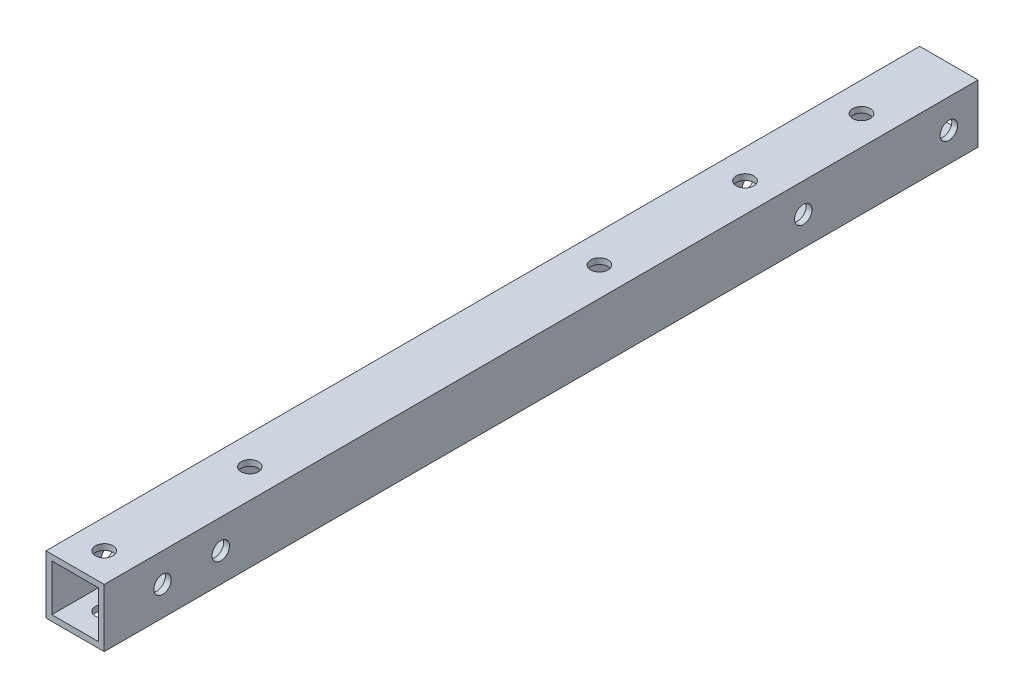
ISO-10303-21;
HEADER;
FILE_DESCRIPTION(('STEP AP214'),'2;1');
FILE_NAME('part.step','',(''),(''),'','','');
FILE_SCHEMA(('AUTOMOTIVE_DESIGN { 1 0 10303 214 1 1 1 1 }'));
ENDSEC;
DATA;
#1=APPLICATION_CONTEXT('core data for automotive mechanical design processes');
#2=APPLICATION_PROTOCOL_DEFINITION('international standard','automotive_design',2000,#1);
#3=PRODUCT_CONTEXT('',#1,'mechanical');
#4=PRODUCT('Part','Part','',(#3));
#5=PRODUCT_RELATED_PRODUCT_CATEGORY('part','',(#4));
#6=PRODUCT_DEFINITION_FORMATION('','',#4);
#7=PRODUCT_DEFINITION_CONTEXT('part definition',#1,'design');
#8=PRODUCT_DEFINITION('design','',#6,#7);
#9=PRODUCT_DEFINITION_SHAPE('','',#8);
#10=(LENGTH_UNIT() NAMED_UNIT(*) SI_UNIT(.MILLI.,.METRE.));
#11=(NAMED_UNIT(*) PLANE_ANGLE_UNIT() SI_UNIT($,.RADIAN.));
#12=(NAMED_UNIT(*) SI_UNIT($,.STERADIAN.) SOLID_ANGLE_UNIT());
#13=UNCERTAINTY_MEASURE_WITH_UNIT(LENGTH_MEASURE(1.E-05),#10,'distance_accuracy_value','');
#14=(GEOMETRIC_REPRESENTATION_CONTEXT(3) GLOBAL_UNCERTAINTY_ASSIGNED_CONTEXT((#13)) GLOBAL_UNIT_ASSIGNED_CONTEXT((#10,
#11,#12)) REPRESENTATION_CONTEXT('',''));
#15=CARTESIAN_POINT('',(0.,0.,0.));
#16=DIRECTION('',(0.,0.,1.));
#17=DIRECTION('',(1.,0.,0.));
#18=AXIS2_PLACEMENT_3D('',#15,#16,#17);
#19=CARTESIAN_POINT('',(0.,0.,150.));
#20=DIRECTION('',(0.,0.,1.));
#21=DIRECTION('',(1.,0.,0.));
#22=AXIS2_PLACEMENT_3D('',#19,#20,#21);
#23=PLANE('',#22);
#24=DIRECTION('',(0.,1.,0.));
#25=VECTOR('',#24,1.);
#26=CARTESIAN_POINT('',(216.70379394576,104.487320339915,150.));
#27=LINE('',#26,#25);
#28=CARTESIAN_POINT('',(216.70379394576,94.4873203399152,150.));
#29=VERTEX_POINT('',#28);
#30=CARTESIAN_POINT('',(216.70379394576,104.487320339915,150.));
#31=VERTEX_POINT('',#30);
#32=EDGE_CURVE('E168',#29,#31,#27,.T.);
#33=ORIENTED_EDGE('',*,*,#32,.T.);
#34=DIRECTION('',(-1.,0.,0.));
#35=VECTOR('',#34,1.);
#36=CARTESIAN_POINT('',(216.70379394576,104.487320339915,150.));
#37=LINE('',#36,#35);
#38=CARTESIAN_POINT('',(206.70379394576,104.487320339915,150.));
#39=VERTEX_POINT('',#38);
#40=EDGE_CURVE('E171',#31,#39,#37,.T.);
#41=ORIENTED_EDGE('',*,*,#40,.T.);
#42=DIRECTION('',(0.,-1.,0.));
#43=VECTOR('',#42,1.);
#44=CARTESIAN_POINT('',(206.70379394576,104.487320339915,150.));
#45=LINE('',#44,#43);
#46=CARTESIAN_POINT('',(206.70379394576,94.4873203399152,150.));
#47=VERTEX_POINT('',#46);
#48=EDGE_CURVE('E174',#39,#47,#45,.T.);
#49=ORIENTED_EDGE('',*,*,#48,.T.);
#50=DIRECTION('',(1.,0.,0.));
#51=VECTOR('',#50,1.);
#52=CARTESIAN_POINT('',(216.70379394576,94.4873203399152,150.));
#53=LINE('',#52,#51);
#54=EDGE_CURVE('E176',#47,#29,#53,.T.);
#55=ORIENTED_EDGE('',*,*,#54,.T.);
#56=EDGE_LOOP('',(#33,#41,#49,#55));
#57=FACE_BOUND('',#56,.T.);
#58=DIRECTION('',(-1.,0.,0.));
#59=VECTOR('',#58,1.);
#60=CARTESIAN_POINT('',(0.,103.487320339915,150.));
#61=LINE('',#60,#59);
#62=CARTESIAN_POINT('',(215.70379394576,103.487320339915,150.));
#63=VERTEX_POINT('',#62);
#64=CARTESIAN_POINT('',(207.70379394576,103.487320339915,150.));
#65=VERTEX_POINT('',#64);
#66=EDGE_CURVE('E138',#63,#65,#61,.T.);
#67=ORIENTED_EDGE('',*,*,#66,.F.);
#68=DIRECTION('',(0.,1.,0.));
#69=VECTOR('',#68,1.);
#70=CARTESIAN_POINT('',(215.70379394576,0.,150.));
#71=LINE('',#70,#69);
#72=CARTESIAN_POINT('',(215.70379394576,95.4873203399152,150.));
#73=VERTEX_POINT('',#72);
#74=EDGE_CURVE('E130',#73,#63,#71,.T.);
#75=ORIENTED_EDGE('',*,*,#74,.F.);
#76=DIRECTION('',(1.,0.,0.));
#77=VECTOR('',#76,1.);
#78=CARTESIAN_POINT('',(0.,95.4873203399152,150.));
#79=LINE('',#78,#77);
#80=CARTESIAN_POINT('',(207.70379394576,95.4873203399152,150.));
#81=VERTEX_POINT('',#80);
#82=EDGE_CURVE('E152',#81,#73,#79,.T.);
#83=ORIENTED_EDGE('',*,*,#82,.F.);
#84=DIRECTION('',(0.,-1.,0.));
#85=VECTOR('',#84,1.);
#86=CARTESIAN_POINT('',(207.70379394576,0.,150.));
#87=LINE('',#86,#85);
#88=EDGE_CURVE('E150',#65,#81,#87,.T.);
#89=ORIENTED_EDGE('',*,*,#88,.F.);
#90=EDGE_LOOP('',(#67,#75,#83,#89));
#91=FACE_BOUND('',#90,.T.);
#92=ADVANCED_FACE('F63',(#57,#91),#23,.T.);
#93=CARTESIAN_POINT('',(0.,0.,0.));
#94=DIRECTION('',(0.,0.,1.));
#95=DIRECTION('',(1.,0.,0.));
#96=AXIS2_PLACEMENT_3D('',#93,#94,#95);
#97=PLANE('',#96);
#98=DIRECTION('',(0.,1.,0.));
#99=VECTOR('',#98,1.);
#100=CARTESIAN_POINT('',(216.70379394576,104.487320339915,0.));
#101=LINE('',#100,#99);
#102=CARTESIAN_POINT('',(216.70379394576,94.4873203399152,0.));
#103=VERTEX_POINT('',#102);
#104=CARTESIAN_POINT('',(216.70379394576,104.487320339915,0.));
#105=VERTEX_POINT('',#104);
#106=EDGE_CURVE('E146',#103,#105,#101,.T.);
#107=ORIENTED_EDGE('',*,*,#106,.F.);
#108=DIRECTION('',(1.,0.,0.));
#109=VECTOR('',#108,1.);
#110=CARTESIAN_POINT('',(216.70379394576,94.4873203399152,0.));
#111=LINE('',#110,#109);
#112=CARTESIAN_POINT('',(206.70379394576,94.4873203399152,0.));
#113=VERTEX_POINT('',#112);
#114=EDGE_CURVE('E172',#113,#103,#111,.T.);
#115=ORIENTED_EDGE('',*,*,#114,.F.);
#116=DIRECTION('',(0.,-1.,0.));
#117=VECTOR('',#116,1.);
#118=CARTESIAN_POINT('',(206.70379394576,104.487320339915,0.));
#119=LINE('',#118,#117);
#120=CARTESIAN_POINT('',(206.70379394576,104.487320339915,0.));
#121=VERTEX_POINT('',#120);
#122=EDGE_CURVE('E183',#121,#113,#119,.T.);
#123=ORIENTED_EDGE('',*,*,#122,.F.);
#124=DIRECTION('',(-1.,0.,0.));
#125=VECTOR('',#124,1.);
#126=CARTESIAN_POINT('',(216.70379394576,104.487320339915,0.));
#127=LINE('',#126,#125);
#128=EDGE_CURVE('E181',#105,#121,#127,.T.);
#129=ORIENTED_EDGE('',*,*,#128,.F.);
#130=EDGE_LOOP('',(#107,#115,#123,#129));
#131=FACE_BOUND('',#130,.T.);
#132=DIRECTION('',(0.,1.,0.));
#133=VECTOR('',#132,1.);
#134=CARTESIAN_POINT('',(215.70379394576,0.,0.));
#135=LINE('',#134,#133);
#136=CARTESIAN_POINT('',(215.70379394576,95.4873203399152,0.));
#137=VERTEX_POINT('',#136);
#138=CARTESIAN_POINT('',(215.70379394576,103.487320339915,0.));
#139=VERTEX_POINT('',#138);
#140=EDGE_CURVE('E88',#137,#139,#135,.T.);
#141=ORIENTED_EDGE('',*,*,#140,.T.);
#142=DIRECTION('',(-1.,0.,0.));
#143=VECTOR('',#142,1.);
#144=CARTESIAN_POINT('',(0.,103.487320339915,0.));
#145=LINE('',#144,#143);
#146=CARTESIAN_POINT('',(207.70379394576,103.487320339915,0.));
#147=VERTEX_POINT('',#146);
#148=EDGE_CURVE('E145',#139,#147,#145,.T.);
#149=ORIENTED_EDGE('',*,*,#148,.T.);
#150=DIRECTION('',(0.,-1.,0.));
#151=VECTOR('',#150,1.);
#152=CARTESIAN_POINT('',(207.70379394576,0.,0.));
#153=LINE('',#152,#151);
#154=CARTESIAN_POINT('',(207.70379394576,95.4873203399152,0.));
#155=VERTEX_POINT('',#154);
#156=EDGE_CURVE('E160',#147,#155,#153,.T.);
#157=ORIENTED_EDGE('',*,*,#156,.T.);
#158=DIRECTION('',(1.,0.,0.));
#159=VECTOR('',#158,1.);
#160=CARTESIAN_POINT('',(0.,95.4873203399152,0.));
#161=LINE('',#160,#159);
#162=EDGE_CURVE('E139',#155,#137,#161,.T.);
#163=ORIENTED_EDGE('',*,*,#162,.T.);
#164=EDGE_LOOP('',(#141,#149,#157,#163));
#165=FACE_BOUND('',#164,.T.);
#166=ADVANCED_FACE('F294',(#131,#165),#97,.F.);
#167=CARTESIAN_POINT('',(216.70379394576,104.487320339915,150.));
#168=DIRECTION('',(-1.,0.,0.));
#169=DIRECTION('',(0.,0.,1.));
#170=AXIS2_PLACEMENT_3D('',#167,#168,#169);
#171=PLANE('',#170);
#172=CARTESIAN_POINT('',(216.70379394576,99.4873203399151,140.));
#173=DIRECTION('',(1.,0.,0.));
#174=DIRECTION('',(0.,0.,-1.));
#175=AXIS2_PLACEMENT_3D('',#172,#173,#174);
#176=CIRCLE('',#175,1.5);
#177=CARTESIAN_POINT('',(216.70379394576,99.4873203399151,138.5));
#178=VERTEX_POINT('',#177);
#179=EDGE_CURVE('E252',#178,#178,#176,.T.);
#180=ORIENTED_EDGE('',*,*,#179,.F.);
#181=EDGE_LOOP('',(#180));
#182=FACE_BOUND('',#181,.T.);
#183=CARTESIAN_POINT('',(216.70379394576,99.4873203399151,130.));
#184=DIRECTION('',(1.,0.,0.));
#185=DIRECTION('',(0.,0.,-1.));
#186=AXIS2_PLACEMENT_3D('',#183,#184,#185);
#187=CIRCLE('',#186,1.5);
#188=CARTESIAN_POINT('',(216.70379394576,99.4873203399151,128.5));
#189=VERTEX_POINT('',#188);
#190=EDGE_CURVE('E246',#189,#189,#187,.T.);
#191=ORIENTED_EDGE('',*,*,#190,.F.);
#192=EDGE_LOOP('',(#191));
#193=FACE_BOUND('',#192,.T.);
#194=CARTESIAN_POINT('',(216.70379394576,99.4873203399151,5.));
#195=DIRECTION('',(1.,0.,0.));
#196=DIRECTION('',(0.,0.,-1.));
#197=AXIS2_PLACEMENT_3D('',#194,#195,#196);
#198=CIRCLE('',#197,1.5);
#199=CARTESIAN_POINT('',(216.70379394576,99.4873203399151,3.5));
#200=VERTEX_POINT('',#199);
#201=EDGE_CURVE('E239',#200,#200,#198,.T.);
#202=ORIENTED_EDGE('',*,*,#201,.F.);
#203=EDGE_LOOP('',(#202));
#204=FACE_BOUND('',#203,.T.);
#205=CARTESIAN_POINT('',(216.70379394576,99.4873203399151,30.));
#206=DIRECTION('',(1.,0.,0.));
#207=DIRECTION('',(0.,0.,-1.));
#208=AXIS2_PLACEMENT_3D('',#205,#206,#207);
#209=CIRCLE('',#208,1.5);
#210=CARTESIAN_POINT('',(216.70379394576,99.4873203399151,28.5));
#211=VERTEX_POINT('',#210);
#212=EDGE_CURVE('E242',#211,#211,#209,.T.);
#213=ORIENTED_EDGE('',*,*,#212,.F.);
#214=EDGE_LOOP('',(#213));
#215=FACE_BOUND('',#214,.T.);
#216=ORIENTED_EDGE('',*,*,#106,.T.);
#217=DIRECTION('',(0.,0.,-1.));
#218=VECTOR('',#217,1.);
#219=CARTESIAN_POINT('',(216.70379394576,104.487320339915,150.));
#220=LINE('',#219,#218);
#221=EDGE_CURVE('E12',#31,#105,#220,.T.);
#222=ORIENTED_EDGE('',*,*,#221,.F.);
#223=ORIENTED_EDGE('',*,*,#32,.F.);
#224=DIRECTION('',(0.,0.,-1.));
#225=VECTOR('',#224,1.);
#226=CARTESIAN_POINT('',(216.70379394576,94.4873203399152,150.));
#227=LINE('',#226,#225);
#228=EDGE_CURVE('E178',#29,#103,#227,.T.);
#229=ORIENTED_EDGE('',*,*,#228,.T.);
#230=EDGE_LOOP('',(#216,#222,#223,#229));
#231=FACE_BOUND('',#230,.T.);
#232=ADVANCED_FACE('F65',(#182,#193,#204,#215,#231),#171,.F.);
#233=CARTESIAN_POINT('',(216.70379394576,104.487320339915,150.));
#234=DIRECTION('',(0.,-1.,0.));
#235=DIRECTION('',(0.,0.,-1.));
#236=AXIS2_PLACEMENT_3D('',#233,#234,#235);
#237=PLANE('',#236);
#238=CARTESIAN_POINT('',(211.70379394576,104.487320339915,15.));
#239=DIRECTION('',(0.,-1.,0.));
#240=DIRECTION('',(0.,0.,-1.));
#241=AXIS2_PLACEMENT_3D('',#238,#239,#240);
#242=CIRCLE('',#241,1.5);
#243=CARTESIAN_POINT('',(211.70379394576,104.487320339915,13.5));
#244=VERTEX_POINT('',#243);
#245=EDGE_CURVE('E213',#244,#244,#242,.T.);
#246=ORIENTED_EDGE('',*,*,#245,.T.);
#247=EDGE_LOOP('',(#246));
#248=FACE_BOUND('',#247,.T.);
#249=CARTESIAN_POINT('',(211.70379394576,104.487320339915,60.));
#250=DIRECTION('',(0.,-1.,0.));
#251=DIRECTION('',(0.,0.,-1.));
#252=AXIS2_PLACEMENT_3D('',#249,#250,#251);
#253=CIRCLE('',#252,1.5);
#254=CARTESIAN_POINT('',(211.70379394576,104.487320339915,58.5));
#255=VERTEX_POINT('',#254);
#256=EDGE_CURVE('E411',#255,#255,#253,.T.);
#257=ORIENTED_EDGE('',*,*,#256,.T.);
#258=EDGE_LOOP('',(#257));
#259=FACE_BOUND('',#258,.T.);
#260=CARTESIAN_POINT('',(211.70379394576,104.487320339915,145.));
#261=DIRECTION('',(0.,-1.,0.));
#262=DIRECTION('',(0.,0.,-1.));
#263=AXIS2_PLACEMENT_3D('',#260,#261,#262);
#264=CIRCLE('',#263,1.5);
#265=CARTESIAN_POINT('',(211.70379394576,104.487320339915,143.5));
#266=VERTEX_POINT('',#265);
#267=EDGE_CURVE('E405',#266,#266,#264,.T.);
#268=ORIENTED_EDGE('',*,*,#267,.T.);
#269=EDGE_LOOP('',(#268));
#270=FACE_BOUND('',#269,.T.);
#271=CARTESIAN_POINT('',(211.70379394576,104.487320339915,35.));
#272=DIRECTION('',(0.,-1.,0.));
#273=DIRECTION('',(0.,0.,-1.));
#274=AXIS2_PLACEMENT_3D('',#271,#272,#273);
#275=CIRCLE('',#274,1.5);
#276=CARTESIAN_POINT('',(211.70379394576,104.487320339915,33.5));
#277=VERTEX_POINT('',#276);
#278=EDGE_CURVE('E404',#277,#277,#275,.T.);
#279=ORIENTED_EDGE('',*,*,#278,.T.);
#280=EDGE_LOOP('',(#279));
#281=FACE_BOUND('',#280,.T.);
#282=CARTESIAN_POINT('',(211.70379394576,104.487320339915,120.));
#283=DIRECTION('',(0.,-1.,0.));
#284=DIRECTION('',(0.,0.,-1.));
#285=AXIS2_PLACEMENT_3D('',#282,#283,#284);
#286=CIRCLE('',#285,1.5);
#287=CARTESIAN_POINT('',(211.70379394576,104.487320339915,118.5));
#288=VERTEX_POINT('',#287);
#289=EDGE_CURVE('E416',#288,#288,#286,.T.);
#290=ORIENTED_EDGE('',*,*,#289,.T.);
#291=EDGE_LOOP('',(#290));
#292=FACE_BOUND('',#291,.T.);
#293=ORIENTED_EDGE('',*,*,#128,.T.);
#294=DIRECTION('',(0.,0.,-1.));
#295=VECTOR('',#294,1.);
#296=CARTESIAN_POINT('',(206.70379394576,104.487320339915,150.));
#297=LINE('',#296,#295);
#298=EDGE_CURVE('E72',#39,#121,#297,.T.);
#299=ORIENTED_EDGE('',*,*,#298,.F.);
#300=ORIENTED_EDGE('',*,*,#40,.F.);
#301=ORIENTED_EDGE('',*,*,#221,.T.);
#302=EDGE_LOOP('',(#293,#299,#300,#301));
#303=FACE_BOUND('',#302,.T.);
#304=ADVANCED_FACE('F293',(#248,#259,#270,#281,#292,#303),#237,.F.);
#305=CARTESIAN_POINT('',(206.70379394576,104.487320339915,150.));
#306=DIRECTION('',(1.,0.,0.));
#307=DIRECTION('',(0.,0.,-1.));
#308=AXIS2_PLACEMENT_3D('',#305,#306,#307);
#309=PLANE('',#308);
#310=CARTESIAN_POINT('',(206.70379394576,99.4873203399151,140.));
#311=DIRECTION('',(1.,0.,0.));
#312=DIRECTION('',(0.,0.,-1.));
#313=AXIS2_PLACEMENT_3D('',#310,#311,#312);
#314=CIRCLE('',#313,1.5);
#315=CARTESIAN_POINT('',(206.70379394576,99.4873203399151,138.5));
#316=VERTEX_POINT('',#315);
#317=EDGE_CURVE('E238',#316,#316,#314,.T.);
#318=ORIENTED_EDGE('',*,*,#317,.T.);
#319=EDGE_LOOP('',(#318));
#320=FACE_BOUND('',#319,.T.);
#321=CARTESIAN_POINT('',(206.70379394576,99.4873203399151,130.));
#322=DIRECTION('',(1.,0.,0.));
#323=DIRECTION('',(0.,0.,-1.));
#324=AXIS2_PLACEMENT_3D('',#321,#322,#323);
#325=CIRCLE('',#324,1.5);
#326=CARTESIAN_POINT('',(206.70379394576,99.4873203399151,128.5));
#327=VERTEX_POINT('',#326);
#328=EDGE_CURVE('E249',#327,#327,#325,.T.);
#329=ORIENTED_EDGE('',*,*,#328,.T.);
#330=EDGE_LOOP('',(#329));
#331=FACE_BOUND('',#330,.T.);
#332=CARTESIAN_POINT('',(206.70379394576,99.4873203399151,5.));
#333=DIRECTION('',(1.,0.,0.));
#334=DIRECTION('',(0.,0.,-1.));
#335=AXIS2_PLACEMENT_3D('',#332,#333,#334);
#336=CIRCLE('',#335,1.5);
#337=CARTESIAN_POINT('',(206.70379394576,99.4873203399151,3.5));
#338=VERTEX_POINT('',#337);
#339=EDGE_CURVE('E243',#338,#338,#336,.T.);
#340=ORIENTED_EDGE('',*,*,#339,.T.);
#341=EDGE_LOOP('',(#340));
#342=FACE_BOUND('',#341,.T.);
#343=CARTESIAN_POINT('',(206.70379394576,99.4873203399151,30.));
#344=DIRECTION('',(1.,0.,0.));
#345=DIRECTION('',(0.,0.,-1.));
#346=AXIS2_PLACEMENT_3D('',#343,#344,#345);
#347=CIRCLE('',#346,1.5);
#348=CARTESIAN_POINT('',(206.70379394576,99.4873203399151,28.5));
#349=VERTEX_POINT('',#348);
#350=EDGE_CURVE('E197',#349,#349,#347,.T.);
#351=ORIENTED_EDGE('',*,*,#350,.T.);
#352=EDGE_LOOP('',(#351));
#353=FACE_BOUND('',#352,.T.);
#354=ORIENTED_EDGE('',*,*,#122,.T.);
#355=DIRECTION('',(0.,0.,-1.));
#356=VECTOR('',#355,1.);
#357=CARTESIAN_POINT('',(206.70379394576,94.4873203399152,150.));
#358=LINE('',#357,#356);
#359=EDGE_CURVE('E188',#47,#113,#358,.T.);
#360=ORIENTED_EDGE('',*,*,#359,.F.);
#361=ORIENTED_EDGE('',*,*,#48,.F.);
#362=ORIENTED_EDGE('',*,*,#298,.T.);
#363=EDGE_LOOP('',(#354,#360,#361,#362));
#364=FACE_BOUND('',#363,.T.);
#365=ADVANCED_FACE('F312',(#320,#331,#342,#353,#364),#309,.F.);
#366=CARTESIAN_POINT('',(216.70379394576,94.4873203399152,150.));
#367=DIRECTION('',(0.,1.,0.));
#368=DIRECTION('',(0.,0.,1.));
#369=AXIS2_PLACEMENT_3D('',#366,#367,#368);
#370=PLANE('',#369);
#371=CARTESIAN_POINT('',(211.70379394576,94.4873203399152,15.));
#372=DIRECTION('',(0.,-1.,0.));
#373=DIRECTION('',(0.,0.,-1.));
#374=AXIS2_PLACEMENT_3D('',#371,#372,#373);
#375=CIRCLE('',#374,1.5);
#376=CARTESIAN_POINT('',(211.70379394576,94.4873203399152,13.5));
#377=VERTEX_POINT('',#376);
#378=EDGE_CURVE('E395',#377,#377,#375,.T.);
#379=ORIENTED_EDGE('',*,*,#378,.F.);
#380=EDGE_LOOP('',(#379));
#381=FACE_BOUND('',#380,.T.);
#382=CARTESIAN_POINT('',(211.70379394576,94.4873203399152,60.));
#383=DIRECTION('',(0.,-1.,0.));
#384=DIRECTION('',(0.,0.,-1.));
#385=AXIS2_PLACEMENT_3D('',#382,#383,#384);
#386=CIRCLE('',#385,1.5);
#387=CARTESIAN_POINT('',(211.70379394576,94.4873203399152,58.5));
#388=VERTEX_POINT('',#387);
#389=EDGE_CURVE('E408',#388,#388,#386,.T.);
#390=ORIENTED_EDGE('',*,*,#389,.F.);
#391=EDGE_LOOP('',(#390));
#392=FACE_BOUND('',#391,.T.);
#393=CARTESIAN_POINT('',(211.70379394576,94.4873203399152,145.));
#394=DIRECTION('',(0.,-1.,0.));
#395=DIRECTION('',(0.,0.,-1.));
#396=AXIS2_PLACEMENT_3D('',#393,#394,#395);
#397=CIRCLE('',#396,1.5);
#398=CARTESIAN_POINT('',(211.70379394576,94.4873203399152,143.5));
#399=VERTEX_POINT('',#398);
#400=EDGE_CURVE('E401',#399,#399,#397,.T.);
#401=ORIENTED_EDGE('',*,*,#400,.F.);
#402=EDGE_LOOP('',(#401));
#403=FACE_BOUND('',#402,.T.);
#404=CARTESIAN_POINT('',(211.70379394576,94.4873203399152,35.));
#405=DIRECTION('',(0.,-1.,0.));
#406=DIRECTION('',(0.,0.,-1.));
#407=AXIS2_PLACEMENT_3D('',#404,#405,#406);
#408=CIRCLE('',#407,1.5);
#409=CARTESIAN_POINT('',(211.70379394576,94.4873203399152,33.5));
#410=VERTEX_POINT('',#409);
#411=EDGE_CURVE('E419',#410,#410,#408,.T.);
#412=ORIENTED_EDGE('',*,*,#411,.F.);
#413=EDGE_LOOP('',(#412));
#414=FACE_BOUND('',#413,.T.);
#415=CARTESIAN_POINT('',(211.70379394576,94.4873203399152,120.));
#416=DIRECTION('',(0.,-1.,0.));
#417=DIRECTION('',(0.,0.,-1.));
#418=AXIS2_PLACEMENT_3D('',#415,#416,#417);
#419=CIRCLE('',#418,1.5);
#420=CARTESIAN_POINT('',(211.70379394576,94.4873203399152,118.5));
#421=VERTEX_POINT('',#420);
#422=EDGE_CURVE('E398',#421,#421,#419,.T.);
#423=ORIENTED_EDGE('',*,*,#422,.F.);
#424=EDGE_LOOP('',(#423));
#425=FACE_BOUND('',#424,.T.);
#426=ORIENTED_EDGE('',*,*,#114,.T.);
#427=ORIENTED_EDGE('',*,*,#228,.F.);
#428=ORIENTED_EDGE('',*,*,#54,.F.);
#429=ORIENTED_EDGE('',*,*,#359,.T.);
#430=EDGE_LOOP('',(#426,#427,#428,#429));
#431=FACE_BOUND('',#430,.T.);
#432=ADVANCED_FACE('F274',(#381,#392,#403,#414,#425,#431),#370,.F.);
#433=CARTESIAN_POINT('',(215.70379394576,0.,150.));
#434=DIRECTION('',(-1.,0.,0.));
#435=DIRECTION('',(0.,0.,1.));
#436=AXIS2_PLACEMENT_3D('',#433,#434,#435);
#437=PLANE('',#436);
#438=CARTESIAN_POINT('',(215.70379394576,99.4873203399151,140.));
#439=DIRECTION('',(-1.,0.,0.));
#440=DIRECTION('',(0.,0.,1.));
#441=AXIS2_PLACEMENT_3D('',#438,#439,#440);
#442=CIRCLE('',#441,1.5);
#443=CARTESIAN_POINT('',(215.70379394576,99.4873203399151,141.5));
#444=VERTEX_POINT('',#443);
#445=EDGE_CURVE('E158',#444,#444,#442,.T.);
#446=ORIENTED_EDGE('',*,*,#445,.F.);
#447=EDGE_LOOP('',(#446));
#448=FACE_BOUND('',#447,.T.);
#449=CARTESIAN_POINT('',(215.70379394576,99.4873203399151,130.));
#450=DIRECTION('',(-1.,0.,0.));
#451=DIRECTION('',(0.,0.,1.));
#452=AXIS2_PLACEMENT_3D('',#449,#450,#451);
#453=CIRCLE('',#452,1.5);
#454=CARTESIAN_POINT('',(215.70379394576,99.4873203399151,131.5));
#455=VERTEX_POINT('',#454);
#456=EDGE_CURVE('E205',#455,#455,#453,.T.);
#457=ORIENTED_EDGE('',*,*,#456,.F.);
#458=EDGE_LOOP('',(#457));
#459=FACE_BOUND('',#458,.T.);
#460=CARTESIAN_POINT('',(215.70379394576,99.4873203399151,5.));
#461=DIRECTION('',(-1.,0.,0.));
#462=DIRECTION('',(0.,0.,1.));
#463=AXIS2_PLACEMENT_3D('',#460,#461,#462);
#464=CIRCLE('',#463,1.5);
#465=CARTESIAN_POINT('',(215.70379394576,99.4873203399151,6.5));
#466=VERTEX_POINT('',#465);
#467=EDGE_CURVE('E201',#466,#466,#464,.T.);
#468=ORIENTED_EDGE('',*,*,#467,.F.);
#469=EDGE_LOOP('',(#468));
#470=FACE_BOUND('',#469,.T.);
#471=CARTESIAN_POINT('',(215.70379394576,99.4873203399151,30.));
#472=DIRECTION('',(-1.,0.,0.));
#473=DIRECTION('',(0.,0.,1.));
#474=AXIS2_PLACEMENT_3D('',#471,#472,#473);
#475=CIRCLE('',#474,1.5);
#476=CARTESIAN_POINT('',(215.70379394576,99.4873203399151,31.5));
#477=VERTEX_POINT('',#476);
#478=EDGE_CURVE('E196',#477,#477,#475,.T.);
#479=ORIENTED_EDGE('',*,*,#478,.F.);
#480=EDGE_LOOP('',(#479));
#481=FACE_BOUND('',#480,.T.);
#482=ORIENTED_EDGE('',*,*,#140,.F.);
#483=DIRECTION('',(0.,0.,-1.));
#484=VECTOR('',#483,1.);
#485=CARTESIAN_POINT('',(215.70379394576,95.4873203399152,150.));
#486=LINE('',#485,#484);
#487=EDGE_CURVE('E134',#73,#137,#486,.T.);
#488=ORIENTED_EDGE('',*,*,#487,.F.);
#489=ORIENTED_EDGE('',*,*,#74,.T.);
#490=DIRECTION('',(0.,0.,-1.));
#491=VECTOR('',#490,1.);
#492=CARTESIAN_POINT('',(215.70379394576,103.487320339915,150.));
#493=LINE('',#492,#491);
#494=EDGE_CURVE('E133',#63,#139,#493,.T.);
#495=ORIENTED_EDGE('',*,*,#494,.T.);
#496=EDGE_LOOP('',(#482,#488,#489,#495));
#497=FACE_BOUND('',#496,.T.);
#498=ADVANCED_FACE('F132',(#448,#459,#470,#481,#497),#437,.T.);
#499=CARTESIAN_POINT('',(0.,103.487320339915,150.));
#500=DIRECTION('',(0.,-1.,0.));
#501=DIRECTION('',(0.,0.,-1.));
#502=AXIS2_PLACEMENT_3D('',#499,#500,#501);
#503=PLANE('',#502);
#504=CARTESIAN_POINT('',(211.70379394576,103.487320339915,15.));
#505=DIRECTION('',(0.,-1.,0.));
#506=DIRECTION('',(0.,0.,-1.));
#507=AXIS2_PLACEMENT_3D('',#504,#505,#506);
#508=CIRCLE('',#507,1.5);
#509=CARTESIAN_POINT('',(211.70379394576,103.487320339915,13.5));
#510=VERTEX_POINT('',#509);
#511=EDGE_CURVE('E235',#510,#510,#508,.T.);
#512=ORIENTED_EDGE('',*,*,#511,.F.);
#513=EDGE_LOOP('',(#512));
#514=FACE_BOUND('',#513,.T.);
#515=CARTESIAN_POINT('',(211.70379394576,103.487320339915,60.));
#516=DIRECTION('',(0.,-1.,0.));
#517=DIRECTION('',(0.,0.,-1.));
#518=AXIS2_PLACEMENT_3D('',#515,#516,#517);
#519=CIRCLE('',#518,1.5);
#520=CARTESIAN_POINT('',(211.70379394576,103.487320339915,58.5));
#521=VERTEX_POINT('',#520);
#522=EDGE_CURVE('E223',#521,#521,#519,.T.);
#523=ORIENTED_EDGE('',*,*,#522,.F.);
#524=EDGE_LOOP('',(#523));
#525=FACE_BOUND('',#524,.T.);
#526=CARTESIAN_POINT('',(211.70379394576,103.487320339915,145.));
#527=DIRECTION('',(0.,-1.,0.));
#528=DIRECTION('',(0.,0.,-1.));
#529=AXIS2_PLACEMENT_3D('',#526,#527,#528);
#530=CIRCLE('',#529,1.5);
#531=CARTESIAN_POINT('',(211.70379394576,103.487320339915,143.5));
#532=VERTEX_POINT('',#531);
#533=EDGE_CURVE('E220',#532,#532,#530,.T.);
#534=ORIENTED_EDGE('',*,*,#533,.F.);
#535=EDGE_LOOP('',(#534));
#536=FACE_BOUND('',#535,.T.);
#537=CARTESIAN_POINT('',(211.70379394576,103.487320339915,35.));
#538=DIRECTION('',(0.,-1.,0.));
#539=DIRECTION('',(0.,0.,-1.));
#540=AXIS2_PLACEMENT_3D('',#537,#538,#539);
#541=CIRCLE('',#540,1.5);
#542=CARTESIAN_POINT('',(211.70379394576,103.487320339915,33.5));
#543=VERTEX_POINT('',#542);
#544=EDGE_CURVE('E217',#543,#543,#541,.T.);
#545=ORIENTED_EDGE('',*,*,#544,.F.);
#546=EDGE_LOOP('',(#545));
#547=FACE_BOUND('',#546,.T.);
#548=CARTESIAN_POINT('',(211.70379394576,103.487320339915,120.));
#549=DIRECTION('',(0.,-1.,0.));
#550=DIRECTION('',(0.,0.,-1.));
#551=AXIS2_PLACEMENT_3D('',#548,#549,#550);
#552=CIRCLE('',#551,1.5);
#553=CARTESIAN_POINT('',(211.70379394576,103.487320339915,118.5));
#554=VERTEX_POINT('',#553);
#555=EDGE_CURVE('E212',#554,#554,#552,.T.);
#556=ORIENTED_EDGE('',*,*,#555,.F.);
#557=EDGE_LOOP('',(#556));
#558=FACE_BOUND('',#557,.T.);
#559=ORIENTED_EDGE('',*,*,#148,.F.);
#560=ORIENTED_EDGE('',*,*,#494,.F.);
#561=ORIENTED_EDGE('',*,*,#66,.T.);
#562=DIRECTION('',(0.,0.,-1.));
#563=VECTOR('',#562,1.);
#564=CARTESIAN_POINT('',(207.70379394576,103.487320339915,150.));
#565=LINE('',#564,#563);
#566=EDGE_CURVE('E147',#65,#147,#565,.T.);
#567=ORIENTED_EDGE('',*,*,#566,.T.);
#568=EDGE_LOOP('',(#559,#560,#561,#567));
#569=FACE_BOUND('',#568,.T.);
#570=ADVANCED_FACE('F142',(#514,#525,#536,#547,#558,#569),#503,.T.);
#571=CARTESIAN_POINT('',(207.70379394576,0.,150.));
#572=DIRECTION('',(1.,0.,0.));
#573=DIRECTION('',(0.,0.,-1.));
#574=AXIS2_PLACEMENT_3D('',#571,#572,#573);
#575=PLANE('',#574);
#576=CARTESIAN_POINT('',(207.70379394576,99.4873203399151,140.));
#577=DIRECTION('',(1.,0.,0.));
#578=DIRECTION('',(0.,0.,-1.));
#579=AXIS2_PLACEMENT_3D('',#576,#577,#578);
#580=CIRCLE('',#579,1.5);
#581=CARTESIAN_POINT('',(207.70379394576,99.4873203399151,138.5));
#582=VERTEX_POINT('',#581);
#583=EDGE_CURVE('E206',#582,#582,#580,.T.);
#584=ORIENTED_EDGE('',*,*,#583,.F.);
#585=EDGE_LOOP('',(#584));
#586=FACE_BOUND('',#585,.T.);
#587=CARTESIAN_POINT('',(207.70379394576,99.4873203399151,130.));
#588=DIRECTION('',(1.,0.,0.));
#589=DIRECTION('',(0.,0.,-1.));
#590=AXIS2_PLACEMENT_3D('',#587,#588,#589);
#591=CIRCLE('',#590,1.5);
#592=CARTESIAN_POINT('',(207.70379394576,99.4873203399151,128.5));
#593=VERTEX_POINT('',#592);
#594=EDGE_CURVE('E202',#593,#593,#591,.T.);
#595=ORIENTED_EDGE('',*,*,#594,.F.);
#596=EDGE_LOOP('',(#595));
#597=FACE_BOUND('',#596,.T.);
#598=CARTESIAN_POINT('',(207.70379394576,99.4873203399151,5.));
#599=DIRECTION('',(1.,0.,0.));
#600=DIRECTION('',(0.,0.,-1.));
#601=AXIS2_PLACEMENT_3D('',#598,#599,#600);
#602=CIRCLE('',#601,1.5);
#603=CARTESIAN_POINT('',(207.70379394576,99.4873203399151,3.5));
#604=VERTEX_POINT('',#603);
#605=EDGE_CURVE('E198',#604,#604,#602,.T.);
#606=ORIENTED_EDGE('',*,*,#605,.F.);
#607=EDGE_LOOP('',(#606));
#608=FACE_BOUND('',#607,.T.);
#609=CARTESIAN_POINT('',(207.70379394576,99.4873203399151,30.));
#610=DIRECTION('',(1.,0.,0.));
#611=DIRECTION('',(0.,0.,-1.));
#612=AXIS2_PLACEMENT_3D('',#609,#610,#611);
#613=CIRCLE('',#612,1.5);
#614=CARTESIAN_POINT('',(207.70379394576,99.4873203399151,28.5));
#615=VERTEX_POINT('',#614);
#616=EDGE_CURVE('E193',#615,#615,#613,.T.);
#617=ORIENTED_EDGE('',*,*,#616,.F.);
#618=EDGE_LOOP('',(#617));
#619=FACE_BOUND('',#618,.T.);
#620=ORIENTED_EDGE('',*,*,#156,.F.);
#621=ORIENTED_EDGE('',*,*,#566,.F.);
#622=ORIENTED_EDGE('',*,*,#88,.T.);
#623=DIRECTION('',(0.,0.,-1.));
#624=VECTOR('',#623,1.);
#625=CARTESIAN_POINT('',(207.70379394576,95.4873203399152,150.));
#626=LINE('',#625,#624);
#627=EDGE_CURVE('E80',#81,#155,#626,.T.);
#628=ORIENTED_EDGE('',*,*,#627,.T.);
#629=EDGE_LOOP('',(#620,#621,#622,#628));
#630=FACE_BOUND('',#629,.T.);
#631=ADVANCED_FACE('F333',(#586,#597,#608,#619,#630),#575,.T.);
#632=CARTESIAN_POINT('',(0.,95.4873203399152,150.));
#633=DIRECTION('',(0.,1.,0.));
#634=DIRECTION('',(0.,0.,1.));
#635=AXIS2_PLACEMENT_3D('',#632,#633,#634);
#636=PLANE('',#635);
#637=CARTESIAN_POINT('',(211.70379394576,95.4873203399152,15.));
#638=DIRECTION('',(0.,1.,0.));
#639=DIRECTION('',(0.,0.,1.));
#640=AXIS2_PLACEMENT_3D('',#637,#638,#639);
#641=CIRCLE('',#640,1.5);
#642=CARTESIAN_POINT('',(211.70379394576,95.4873203399152,16.5));
#643=VERTEX_POINT('',#642);
#644=EDGE_CURVE('E67',#643,#643,#641,.T.);
#645=ORIENTED_EDGE('',*,*,#644,.F.);
#646=EDGE_LOOP('',(#645));
#647=FACE_BOUND('',#646,.T.);
#648=CARTESIAN_POINT('',(211.70379394576,95.4873203399152,60.));
#649=DIRECTION('',(0.,1.,0.));
#650=DIRECTION('',(0.,0.,1.));
#651=AXIS2_PLACEMENT_3D('',#648,#649,#650);
#652=CIRCLE('',#651,1.5);
#653=CARTESIAN_POINT('',(211.70379394576,95.4873203399152,61.5));
#654=VERTEX_POINT('',#653);
#655=EDGE_CURVE('E221',#654,#654,#652,.T.);
#656=ORIENTED_EDGE('',*,*,#655,.F.);
#657=EDGE_LOOP('',(#656));
#658=FACE_BOUND('',#657,.T.);
#659=CARTESIAN_POINT('',(211.70379394576,95.4873203399152,145.));
#660=DIRECTION('',(0.,1.,0.));
#661=DIRECTION('',(0.,0.,1.));
#662=AXIS2_PLACEMENT_3D('',#659,#660,#661);
#663=CIRCLE('',#662,1.5);
#664=CARTESIAN_POINT('',(211.70379394576,95.4873203399152,146.5));
#665=VERTEX_POINT('',#664);
#666=EDGE_CURVE('E218',#665,#665,#663,.T.);
#667=ORIENTED_EDGE('',*,*,#666,.F.);
#668=EDGE_LOOP('',(#667));
#669=FACE_BOUND('',#668,.T.);
#670=CARTESIAN_POINT('',(211.70379394576,95.4873203399152,35.));
#671=DIRECTION('',(0.,1.,0.));
#672=DIRECTION('',(0.,0.,1.));
#673=AXIS2_PLACEMENT_3D('',#670,#671,#672);
#674=CIRCLE('',#673,1.5);
#675=CARTESIAN_POINT('',(211.70379394576,95.4873203399152,36.5));
#676=VERTEX_POINT('',#675);
#677=EDGE_CURVE('E214',#676,#676,#674,.T.);
#678=ORIENTED_EDGE('',*,*,#677,.F.);
#679=EDGE_LOOP('',(#678));
#680=FACE_BOUND('',#679,.T.);
#681=CARTESIAN_POINT('',(211.70379394576,95.4873203399152,120.));
#682=DIRECTION('',(0.,1.,0.));
#683=DIRECTION('',(0.,0.,1.));
#684=AXIS2_PLACEMENT_3D('',#681,#682,#683);
#685=CIRCLE('',#684,1.5);
#686=CARTESIAN_POINT('',(211.70379394576,95.4873203399152,121.5));
#687=VERTEX_POINT('',#686);
#688=EDGE_CURVE('E209',#687,#687,#685,.T.);
#689=ORIENTED_EDGE('',*,*,#688,.F.);
#690=EDGE_LOOP('',(#689));
#691=FACE_BOUND('',#690,.T.);
#692=ORIENTED_EDGE('',*,*,#162,.F.);
#693=ORIENTED_EDGE('',*,*,#627,.F.);
#694=ORIENTED_EDGE('',*,*,#82,.T.);
#695=ORIENTED_EDGE('',*,*,#487,.T.);
#696=EDGE_LOOP('',(#692,#693,#694,#695));
#697=FACE_BOUND('',#696,.T.);
#698=ADVANCED_FACE('F337',(#647,#658,#669,#680,#691,#697),#636,.T.);
#699=CARTESIAN_POINT('',(206.70379394576,99.4873203399151,30.));
#700=DIRECTION('',(1.,0.,0.));
#701=DIRECTION('',(0.,0.,-1.));
#702=AXIS2_PLACEMENT_3D('',#699,#700,#701);
#703=CYLINDRICAL_SURFACE('',#702,1.5);
#704=ORIENTED_EDGE('',*,*,#616,.T.);
#705=EDGE_LOOP('',(#704));
#706=FACE_BOUND('',#705,.T.);
#707=ORIENTED_EDGE('',*,*,#350,.F.);
#708=EDGE_LOOP('',(#707));
#709=FACE_BOUND('',#708,.T.);
#710=ADVANCED_FACE('F288',(#706,#709),#703,.F.);
#711=CARTESIAN_POINT('',(206.70379394576,99.4873203399151,5.));
#712=DIRECTION('',(1.,0.,0.));
#713=DIRECTION('',(0.,0.,-1.));
#714=AXIS2_PLACEMENT_3D('',#711,#712,#713);
#715=CYLINDRICAL_SURFACE('',#714,1.5);
#716=ORIENTED_EDGE('',*,*,#605,.T.);
#717=EDGE_LOOP('',(#716));
#718=FACE_BOUND('',#717,.T.);
#719=ORIENTED_EDGE('',*,*,#339,.F.);
#720=EDGE_LOOP('',(#719));
#721=FACE_BOUND('',#720,.T.);
#722=ADVANCED_FACE('F343',(#718,#721),#715,.F.);
#723=CARTESIAN_POINT('',(206.70379394576,99.4873203399151,130.));
#724=DIRECTION('',(1.,0.,0.));
#725=DIRECTION('',(0.,0.,-1.));
#726=AXIS2_PLACEMENT_3D('',#723,#724,#725);
#727=CYLINDRICAL_SURFACE('',#726,1.5);
#728=ORIENTED_EDGE('',*,*,#594,.T.);
#729=EDGE_LOOP('',(#728));
#730=FACE_BOUND('',#729,.T.);
#731=ORIENTED_EDGE('',*,*,#328,.F.);
#732=EDGE_LOOP('',(#731));
#733=FACE_BOUND('',#732,.T.);
#734=ADVANCED_FACE('F347',(#730,#733),#727,.F.);
#735=CARTESIAN_POINT('',(206.70379394576,99.4873203399151,140.));
#736=DIRECTION('',(1.,0.,0.));
#737=DIRECTION('',(0.,0.,-1.));
#738=AXIS2_PLACEMENT_3D('',#735,#736,#737);
#739=CYLINDRICAL_SURFACE('',#738,1.5);
#740=ORIENTED_EDGE('',*,*,#583,.T.);
#741=EDGE_LOOP('',(#740));
#742=FACE_BOUND('',#741,.T.);
#743=ORIENTED_EDGE('',*,*,#317,.F.);
#744=EDGE_LOOP('',(#743));
#745=FACE_BOUND('',#744,.T.);
#746=ADVANCED_FACE('F286',(#742,#745),#739,.F.);
#747=ORIENTED_EDGE('',*,*,#478,.T.);
#748=EDGE_LOOP('',(#747));
#749=FACE_BOUND('',#748,.T.);
#750=ORIENTED_EDGE('',*,*,#212,.T.);
#751=EDGE_LOOP('',(#750));
#752=FACE_BOUND('',#751,.T.);
#753=ADVANCED_FACE('F282',(#749,#752),#703,.F.);
#754=ORIENTED_EDGE('',*,*,#467,.T.);
#755=EDGE_LOOP('',(#754));
#756=FACE_BOUND('',#755,.T.);
#757=ORIENTED_EDGE('',*,*,#201,.T.);
#758=EDGE_LOOP('',(#757));
#759=FACE_BOUND('',#758,.T.);
#760=ADVANCED_FACE('F285',(#756,#759),#715,.F.);
#761=ORIENTED_EDGE('',*,*,#456,.T.);
#762=EDGE_LOOP('',(#761));
#763=FACE_BOUND('',#762,.T.);
#764=ORIENTED_EDGE('',*,*,#190,.T.);
#765=EDGE_LOOP('',(#764));
#766=FACE_BOUND('',#765,.T.);
#767=ADVANCED_FACE('F352',(#763,#766),#727,.F.);
#768=ORIENTED_EDGE('',*,*,#445,.T.);
#769=EDGE_LOOP('',(#768));
#770=FACE_BOUND('',#769,.T.);
#771=ORIENTED_EDGE('',*,*,#179,.T.);
#772=EDGE_LOOP('',(#771));
#773=FACE_BOUND('',#772,.T.);
#774=ADVANCED_FACE('F269',(#770,#773),#739,.F.);
#775=CARTESIAN_POINT('',(211.70379394576,104.487320339915,120.));
#776=DIRECTION('',(0.,-1.,0.));
#777=DIRECTION('',(0.,0.,-1.));
#778=AXIS2_PLACEMENT_3D('',#775,#776,#777);
#779=CYLINDRICAL_SURFACE('',#778,1.5);
#780=ORIENTED_EDGE('',*,*,#688,.T.);
#781=EDGE_LOOP('',(#780));
#782=FACE_BOUND('',#781,.T.);
#783=ORIENTED_EDGE('',*,*,#422,.T.);
#784=EDGE_LOOP('',(#783));
#785=FACE_BOUND('',#784,.T.);
#786=ADVANCED_FACE('F360',(#782,#785),#779,.F.);
#787=CARTESIAN_POINT('',(211.70379394576,104.487320339915,35.));
#788=DIRECTION('',(0.,-1.,0.));
#789=DIRECTION('',(0.,0.,-1.));
#790=AXIS2_PLACEMENT_3D('',#787,#788,#789);
#791=CYLINDRICAL_SURFACE('',#790,1.5);
#792=ORIENTED_EDGE('',*,*,#677,.T.);
#793=EDGE_LOOP('',(#792));
#794=FACE_BOUND('',#793,.T.);
#795=ORIENTED_EDGE('',*,*,#411,.T.);
#796=EDGE_LOOP('',(#795));
#797=FACE_BOUND('',#796,.T.);
#798=ADVANCED_FACE('F356',(#794,#797),#791,.F.);
#799=CARTESIAN_POINT('',(211.70379394576,104.487320339915,145.));
#800=DIRECTION('',(0.,-1.,0.));
#801=DIRECTION('',(0.,0.,-1.));
#802=AXIS2_PLACEMENT_3D('',#799,#800,#801);
#803=CYLINDRICAL_SURFACE('',#802,1.5);
#804=ORIENTED_EDGE('',*,*,#666,.T.);
#805=EDGE_LOOP('',(#804));
#806=FACE_BOUND('',#805,.T.);
#807=ORIENTED_EDGE('',*,*,#400,.T.);
#808=EDGE_LOOP('',(#807));
#809=FACE_BOUND('',#808,.T.);
#810=ADVANCED_FACE('F359',(#806,#809),#803,.F.);
#811=CARTESIAN_POINT('',(211.70379394576,104.487320339915,60.));
#812=DIRECTION('',(0.,-1.,0.));
#813=DIRECTION('',(0.,0.,-1.));
#814=AXIS2_PLACEMENT_3D('',#811,#812,#813);
#815=CYLINDRICAL_SURFACE('',#814,1.5);
#816=ORIENTED_EDGE('',*,*,#655,.T.);
#817=EDGE_LOOP('',(#816));
#818=FACE_BOUND('',#817,.T.);
#819=ORIENTED_EDGE('',*,*,#389,.T.);
#820=EDGE_LOOP('',(#819));
#821=FACE_BOUND('',#820,.T.);
#822=ADVANCED_FACE('F367',(#818,#821),#815,.F.);
#823=CARTESIAN_POINT('',(211.70379394576,104.487320339915,15.));
#824=DIRECTION('',(0.,-1.,0.));
#825=DIRECTION('',(0.,0.,-1.));
#826=AXIS2_PLACEMENT_3D('',#823,#824,#825);
#827=CYLINDRICAL_SURFACE('',#826,1.5);
#828=ORIENTED_EDGE('',*,*,#644,.T.);
#829=EDGE_LOOP('',(#828));
#830=FACE_BOUND('',#829,.T.);
#831=ORIENTED_EDGE('',*,*,#378,.T.);
#832=EDGE_LOOP('',(#831));
#833=FACE_BOUND('',#832,.T.);
#834=ADVANCED_FACE('F370',(#830,#833),#827,.F.);
#835=ORIENTED_EDGE('',*,*,#555,.T.);
#836=EDGE_LOOP('',(#835));
#837=FACE_BOUND('',#836,.T.);
#838=ORIENTED_EDGE('',*,*,#289,.F.);
#839=EDGE_LOOP('',(#838));
#840=FACE_BOUND('',#839,.T.);
#841=ADVANCED_FACE('F366',(#837,#840),#779,.F.);
#842=ORIENTED_EDGE('',*,*,#544,.T.);
#843=EDGE_LOOP('',(#842));
#844=FACE_BOUND('',#843,.T.);
#845=ORIENTED_EDGE('',*,*,#278,.F.);
#846=EDGE_LOOP('',(#845));
#847=FACE_BOUND('',#846,.T.);
#848=ADVANCED_FACE('F362',(#844,#847),#791,.F.);
#849=ORIENTED_EDGE('',*,*,#533,.T.);
#850=EDGE_LOOP('',(#849));
#851=FACE_BOUND('',#850,.T.);
#852=ORIENTED_EDGE('',*,*,#267,.F.);
#853=EDGE_LOOP('',(#852));
#854=FACE_BOUND('',#853,.T.);
#855=ADVANCED_FACE('F375',(#851,#854),#803,.F.);
#856=ORIENTED_EDGE('',*,*,#522,.T.);
#857=EDGE_LOOP('',(#856));
#858=FACE_BOUND('',#857,.T.);
#859=ORIENTED_EDGE('',*,*,#256,.F.);
#860=EDGE_LOOP('',(#859));
#861=FACE_BOUND('',#860,.T.);
#862=ADVANCED_FACE('F371',(#858,#861),#815,.F.);
#863=ORIENTED_EDGE('',*,*,#511,.T.);
#864=EDGE_LOOP('',(#863));
#865=FACE_BOUND('',#864,.T.);
#866=ORIENTED_EDGE('',*,*,#245,.F.);
#867=EDGE_LOOP('',(#866));
#868=FACE_BOUND('',#867,.T.);
#869=ADVANCED_FACE('F378',(#865,#868),#827,.F.);
#870=CLOSED_SHELL('',(#92,#166,#232,#304,#365,#432,#498,#570,#631,#698,#710,#722,#734,#746,#753,
#760,#767,#774,#786,#798,#810,#822,#834,#841,#848,#855,#862,#869));
#871=MANIFOLD_SOLID_BREP('B2',#870);
#872=ADVANCED_BREP_SHAPE_REPRESENTATION('',(#18,#871),#14);
#873=SHAPE_DEFINITION_REPRESENTATION(#9,#872);
ENDSEC;
END-ISO-10303-21;
